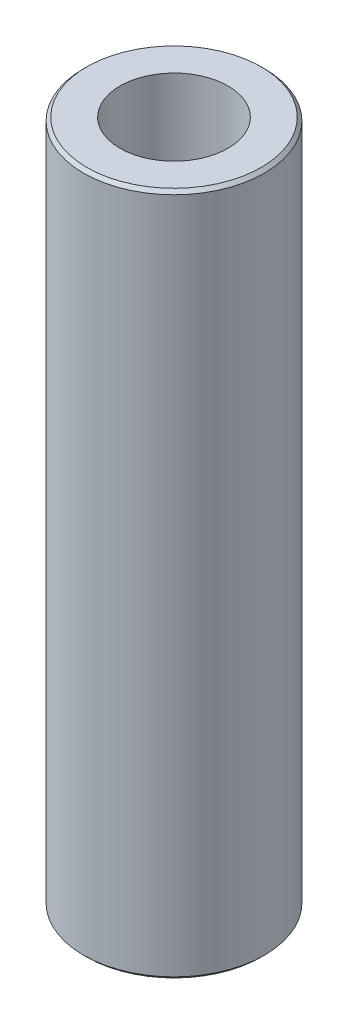
ISO-10303-21;
HEADER;
FILE_DESCRIPTION(('STEP AP214'),'2;1');
FILE_NAME('part.step','',(''),(''),'','','');
FILE_SCHEMA(('AUTOMOTIVE_DESIGN { 1 0 10303 214 1 1 1 1 }'));
ENDSEC;
DATA;
#1=APPLICATION_CONTEXT('core data for automotive mechanical design processes');
#2=APPLICATION_PROTOCOL_DEFINITION('international standard','automotive_design',2000,#1);
#3=PRODUCT_CONTEXT('',#1,'mechanical');
#4=PRODUCT('Part','Part','',(#3));
#5=PRODUCT_RELATED_PRODUCT_CATEGORY('part','',(#4));
#6=PRODUCT_DEFINITION_FORMATION('','',#4);
#7=PRODUCT_DEFINITION_CONTEXT('part definition',#1,'design');
#8=PRODUCT_DEFINITION('design','',#6,#7);
#9=PRODUCT_DEFINITION_SHAPE('','',#8);
#10=(LENGTH_UNIT() NAMED_UNIT(*) SI_UNIT(.MILLI.,.METRE.));
#11=(NAMED_UNIT(*) PLANE_ANGLE_UNIT() SI_UNIT($,.RADIAN.));
#12=(NAMED_UNIT(*) SI_UNIT($,.STERADIAN.) SOLID_ANGLE_UNIT());
#13=UNCERTAINTY_MEASURE_WITH_UNIT(LENGTH_MEASURE(1.E-05),#10,'distance_accuracy_value','');
#14=(GEOMETRIC_REPRESENTATION_CONTEXT(3) GLOBAL_UNCERTAINTY_ASSIGNED_CONTEXT((#13)) GLOBAL_UNIT_ASSIGNED_CONTEXT((#10,
#11,#12)) REPRESENTATION_CONTEXT('',''));
#15=CARTESIAN_POINT('',(0.,0.,0.));
#16=DIRECTION('',(0.,0.,1.));
#17=DIRECTION('',(1.,0.,0.));
#18=AXIS2_PLACEMENT_3D('',#15,#16,#17);
#19=CARTESIAN_POINT('',(0.,75.5906840888996,0.));
#20=DIRECTION('',(0.,-1.,0.));
#21=DIRECTION('',(0.,0.,-1.));
#22=AXIS2_PLACEMENT_3D('',#19,#20,#21);
#23=CYLINDRICAL_SURFACE('',#22,10.);
#24=CARTESIAN_POINT('',(0.,75.2271133635804,0.));
#25=DIRECTION('',(0.,1.,0.));
#26=DIRECTION('',(0.,0.,1.));
#27=AXIS2_PLACEMENT_3D('',#24,#25,#26);
#28=CIRCLE('',#27,10.);
#29=CARTESIAN_POINT('',(0.,75.2271133635804,10.));
#30=VERTEX_POINT('',#29);
#31=EDGE_CURVE('E50',#30,#30,#28,.F.);
#32=ORIENTED_EDGE('',*,*,#31,.T.);
#33=EDGE_LOOP('',(#32));
#34=FACE_BOUND('',#33,.T.);
#35=CARTESIAN_POINT('',(0.,0.363570725319187,0.));
#36=DIRECTION('',(0.,1.,0.));
#37=DIRECTION('',(0.,0.,1.));
#38=AXIS2_PLACEMENT_3D('',#35,#36,#37);
#39=CIRCLE('',#38,10.);
#40=CARTESIAN_POINT('',(0.,0.363570725319187,10.));
#41=VERTEX_POINT('',#40);
#42=EDGE_CURVE('E51',#41,#41,#39,.T.);
#43=ORIENTED_EDGE('',*,*,#42,.T.);
#44=EDGE_LOOP('',(#43));
#45=FACE_BOUND('',#44,.T.);
#46=ADVANCED_FACE('F39',(#34,#45),#23,.T.);
#47=CARTESIAN_POINT('',(0.,75.5906840888996,0.));
#48=DIRECTION('',(0.,1.,0.));
#49=DIRECTION('',(0.,0.,1.));
#50=AXIS2_PLACEMENT_3D('',#47,#48,#49);
#51=PLANE('',#50);
#52=CARTESIAN_POINT('',(0.,75.5906840888996,0.));
#53=DIRECTION('',(0.,1.,0.));
#54=DIRECTION('',(0.,0.,1.));
#55=AXIS2_PLACEMENT_3D('',#52,#53,#54);
#56=CIRCLE('',#55,9.63642927468079);
#57=CARTESIAN_POINT('',(0.,75.5906840888996,9.63642927468079));
#58=VERTEX_POINT('',#57);
#59=EDGE_CURVE('E54',#58,#58,#56,.T.);
#60=ORIENTED_EDGE('',*,*,#59,.T.);
#61=EDGE_LOOP('',(#60));
#62=FACE_BOUND('',#61,.T.);
#63=CARTESIAN_POINT('',(0.,75.5906840888996,0.));
#64=DIRECTION('',(0.,1.,0.));
#65=DIRECTION('',(0.,0.,1.));
#66=AXIS2_PLACEMENT_3D('',#63,#64,#65);
#67=CIRCLE('',#66,5.97253216957999);
#68=CARTESIAN_POINT('',(0.,75.5906840888996,5.97253216957999));
#69=VERTEX_POINT('',#68);
#70=EDGE_CURVE('E58',#69,#69,#67,.T.);
#71=ORIENTED_EDGE('',*,*,#70,.F.);
#72=EDGE_LOOP('',(#71));
#73=FACE_BOUND('',#72,.T.);
#74=ADVANCED_FACE('F69',(#62,#73),#51,.T.);
#75=CARTESIAN_POINT('',(0.,0.,0.));
#76=DIRECTION('',(0.,1.,0.));
#77=DIRECTION('',(0.,0.,1.));
#78=AXIS2_PLACEMENT_3D('',#75,#76,#77);
#79=PLANE('',#78);
#80=CARTESIAN_POINT('',(0.,0.,0.));
#81=DIRECTION('',(0.,1.,0.));
#82=DIRECTION('',(0.,0.,1.));
#83=AXIS2_PLACEMENT_3D('',#80,#81,#82);
#84=CIRCLE('',#83,9.6364292746808);
#85=CARTESIAN_POINT('',(0.,0.,9.6364292746808));
#86=VERTEX_POINT('',#85);
#87=EDGE_CURVE('E10',#86,#86,#84,.F.);
#88=ORIENTED_EDGE('',*,*,#87,.T.);
#89=EDGE_LOOP('',(#88));
#90=FACE_BOUND('',#89,.T.);
#91=CARTESIAN_POINT('',(0.,0.,0.));
#92=DIRECTION('',(0.,1.,0.));
#93=DIRECTION('',(0.,0.,1.));
#94=AXIS2_PLACEMENT_3D('',#91,#92,#93);
#95=CIRCLE('',#94,5.97253216957999);
#96=CARTESIAN_POINT('',(0.,0.,5.97253216957999));
#97=VERTEX_POINT('',#96);
#98=EDGE_CURVE('E63',#97,#97,#95,.T.);
#99=ORIENTED_EDGE('',*,*,#98,.T.);
#100=EDGE_LOOP('',(#99));
#101=FACE_BOUND('',#100,.T.);
#102=ADVANCED_FACE('F75',(#90,#101),#79,.F.);
#103=CARTESIAN_POINT('',(0.,75.5906840888996,0.));
#104=DIRECTION('',(0.,-1.,0.));
#105=DIRECTION('',(0.,0.,-1.));
#106=AXIS2_PLACEMENT_3D('',#103,#104,#105);
#107=CYLINDRICAL_SURFACE('',#106,5.97253216957999);
#108=ORIENTED_EDGE('',*,*,#70,.T.);
#109=EDGE_LOOP('',(#108));
#110=FACE_BOUND('',#109,.T.);
#111=ORIENTED_EDGE('',*,*,#98,.F.);
#112=EDGE_LOOP('',(#111));
#113=FACE_BOUND('',#112,.T.);
#114=ADVANCED_FACE('F70',(#110,#113),#107,.F.);
#115=CARTESIAN_POINT('',(0.,75.5906840888996,0.));
#116=DIRECTION('',(0.,-1.,0.));
#117=DIRECTION('',(0.,0.,-1.));
#118=AXIS2_PLACEMENT_3D('',#115,#116,#117);
#119=CONICAL_SURFACE('',#118,9.63642927468079,0.785398163397455);
#120=ORIENTED_EDGE('',*,*,#31,.F.);
#121=EDGE_LOOP('',(#120));
#122=FACE_BOUND('',#121,.T.);
#123=ORIENTED_EDGE('',*,*,#59,.F.);
#124=EDGE_LOOP('',(#123));
#125=FACE_BOUND('',#124,.T.);
#126=ADVANCED_FACE('F81',(#122,#125),#119,.T.);
#127=CARTESIAN_POINT('',(0.,0.363570725319187,0.));
#128=DIRECTION('',(0.,1.,0.));
#129=DIRECTION('',(0.,0.,1.));
#130=AXIS2_PLACEMENT_3D('',#127,#128,#129);
#131=CONICAL_SURFACE('',#130,10.,0.785398163397465);
#132=ORIENTED_EDGE('',*,*,#87,.F.);
#133=EDGE_LOOP('',(#132));
#134=FACE_BOUND('',#133,.T.);
#135=ORIENTED_EDGE('',*,*,#42,.F.);
#136=EDGE_LOOP('',(#135));
#137=FACE_BOUND('',#136,.T.);
#138=ADVANCED_FACE('F45',(#134,#137),#131,.T.);
#139=CLOSED_SHELL('',(#46,#74,#102,#114,#126,#138));
#140=MANIFOLD_SOLID_BREP('B2',#139);
#141=ADVANCED_BREP_SHAPE_REPRESENTATION('',(#18,#140),#14);
#142=SHAPE_DEFINITION_REPRESENTATION(#9,#141);
ENDSEC;
END-ISO-10303-21;
